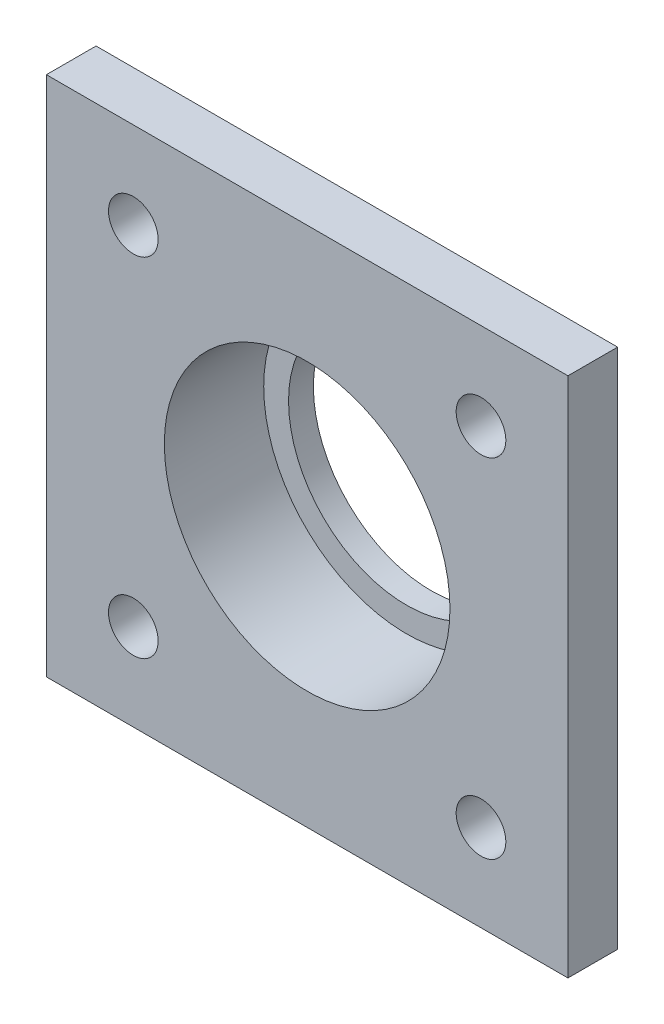
ISO-10303-21;
HEADER;
FILE_DESCRIPTION(('STEP AP214'),'2;1');
FILE_NAME('part.step','',(''),(''),'','','');
FILE_SCHEMA(('AUTOMOTIVE_DESIGN { 1 0 10303 214 1 1 1 1 }'));
ENDSEC;
DATA;
#1=APPLICATION_CONTEXT('core data for automotive mechanical design processes');
#2=APPLICATION_PROTOCOL_DEFINITION('international standard','automotive_design',2000,#1);
#3=PRODUCT_CONTEXT('',#1,'mechanical');
#4=PRODUCT('Part','Part','',(#3));
#5=PRODUCT_RELATED_PRODUCT_CATEGORY('part','',(#4));
#6=PRODUCT_DEFINITION_FORMATION('','',#4);
#7=PRODUCT_DEFINITION_CONTEXT('part definition',#1,'design');
#8=PRODUCT_DEFINITION('design','',#6,#7);
#9=PRODUCT_DEFINITION_SHAPE('','',#8);
#10=(LENGTH_UNIT() NAMED_UNIT(*) SI_UNIT(.MILLI.,.METRE.));
#11=(NAMED_UNIT(*) PLANE_ANGLE_UNIT() SI_UNIT($,.RADIAN.));
#12=(NAMED_UNIT(*) SI_UNIT($,.STERADIAN.) SOLID_ANGLE_UNIT());
#13=UNCERTAINTY_MEASURE_WITH_UNIT(LENGTH_MEASURE(1.E-05),#10,'distance_accuracy_value','');
#14=(GEOMETRIC_REPRESENTATION_CONTEXT(3) GLOBAL_UNCERTAINTY_ASSIGNED_CONTEXT((#13)) GLOBAL_UNIT_ASSIGNED_CONTEXT((#10,
#11,#12)) REPRESENTATION_CONTEXT('',''));
#15=CARTESIAN_POINT('',(0.,0.,0.));
#16=DIRECTION('',(0.,0.,1.));
#17=DIRECTION('',(1.,0.,0.));
#18=AXIS2_PLACEMENT_3D('',#15,#16,#17);
#19=CARTESIAN_POINT('',(0.,0.,4.));
#20=DIRECTION('',(0.,0.,-1.));
#21=DIRECTION('',(-1.,0.,0.));
#22=AXIS2_PLACEMENT_3D('',#19,#20,#21);
#23=CYLINDRICAL_SURFACE('',#22,11.5);
#24=CARTESIAN_POINT('',(0.,0.,4.));
#25=DIRECTION('',(0.,0.,1.));
#26=DIRECTION('',(1.,0.,0.));
#27=AXIS2_PLACEMENT_3D('',#24,#25,#26);
#28=CIRCLE('',#27,11.5);
#29=CARTESIAN_POINT('',(11.5,0.,4.));
#30=VERTEX_POINT('',#29);
#31=EDGE_CURVE('E212',#30,#30,#28,.T.);
#32=ORIENTED_EDGE('',*,*,#31,.T.);
#33=EDGE_LOOP('',(#32));
#34=FACE_BOUND('',#33,.T.);
#35=CARTESIAN_POINT('',(0.,0.,-4.));
#36=DIRECTION('',(0.,0.,-1.));
#37=DIRECTION('',(-1.,0.,0.));
#38=AXIS2_PLACEMENT_3D('',#35,#36,#37);
#39=CIRCLE('',#38,11.5);
#40=CARTESIAN_POINT('',(-11.5,0.,-4.));
#41=VERTEX_POINT('',#40);
#42=EDGE_CURVE('E233',#41,#41,#39,.T.);
#43=ORIENTED_EDGE('',*,*,#42,.T.);
#44=EDGE_LOOP('',(#43));
#45=FACE_BOUND('',#44,.T.);
#46=ADVANCED_FACE('F41',(#34,#45),#23,.F.);
#47=CARTESIAN_POINT('',(0.,-21.,4.));
#48=DIRECTION('',(0.,1.,0.));
#49=DIRECTION('',(0.,0.,1.));
#50=AXIS2_PLACEMENT_3D('',#47,#48,#49);
#51=PLANE('',#50);
#52=DIRECTION('',(1.,0.,0.));
#53=VECTOR('',#52,1.);
#54=CARTESIAN_POINT('',(0.,-21.,0.));
#55=LINE('',#54,#53);
#56=CARTESIAN_POINT('',(-21.,-21.,0.));
#57=VERTEX_POINT('',#56);
#58=CARTESIAN_POINT('',(21.,-21.,0.));
#59=VERTEX_POINT('',#58);
#60=EDGE_CURVE('E131',#57,#59,#55,.T.);
#61=ORIENTED_EDGE('',*,*,#60,.T.);
#62=DIRECTION('',(0.,0.,-1.));
#63=VECTOR('',#62,1.);
#64=CARTESIAN_POINT('',(21.,-21.,4.));
#65=LINE('',#64,#63);
#66=CARTESIAN_POINT('',(21.,-21.,4.));
#67=VERTEX_POINT('',#66);
#68=EDGE_CURVE('E104',#67,#59,#65,.T.);
#69=ORIENTED_EDGE('',*,*,#68,.F.);
#70=DIRECTION('',(1.,0.,0.));
#71=VECTOR('',#70,1.);
#72=CARTESIAN_POINT('',(0.,-21.,4.));
#73=LINE('',#72,#71);
#74=CARTESIAN_POINT('',(-21.,-21.,4.));
#75=VERTEX_POINT('',#74);
#76=EDGE_CURVE('E93',#75,#67,#73,.T.);
#77=ORIENTED_EDGE('',*,*,#76,.F.);
#78=DIRECTION('',(0.,0.,-1.));
#79=VECTOR('',#78,1.);
#80=CARTESIAN_POINT('',(-21.,-21.,4.));
#81=LINE('',#80,#79);
#82=EDGE_CURVE('E59',#75,#57,#81,.T.);
#83=ORIENTED_EDGE('',*,*,#82,.T.);
#84=EDGE_LOOP('',(#61,#69,#77,#83));
#85=FACE_BOUND('',#84,.T.);
#86=ADVANCED_FACE('F167',(#85),#51,.F.);
#87=CARTESIAN_POINT('',(21.,0.,4.));
#88=DIRECTION('',(-1.,0.,0.));
#89=DIRECTION('',(0.,0.,1.));
#90=AXIS2_PLACEMENT_3D('',#87,#88,#89);
#91=PLANE('',#90);
#92=DIRECTION('',(0.,1.,0.));
#93=VECTOR('',#92,1.);
#94=CARTESIAN_POINT('',(21.,0.,0.));
#95=LINE('',#94,#93);
#96=CARTESIAN_POINT('',(21.,21.,0.));
#97=VERTEX_POINT('',#96);
#98=EDGE_CURVE('E100',#59,#97,#95,.T.);
#99=ORIENTED_EDGE('',*,*,#98,.T.);
#100=DIRECTION('',(0.,0.,-1.));
#101=VECTOR('',#100,1.);
#102=CARTESIAN_POINT('',(21.,21.,4.));
#103=LINE('',#102,#101);
#104=CARTESIAN_POINT('',(21.,21.,4.));
#105=VERTEX_POINT('',#104);
#106=EDGE_CURVE('E98',#105,#97,#103,.T.);
#107=ORIENTED_EDGE('',*,*,#106,.F.);
#108=DIRECTION('',(0.,1.,0.));
#109=VECTOR('',#108,1.);
#110=CARTESIAN_POINT('',(21.,0.,4.));
#111=LINE('',#110,#109);
#112=EDGE_CURVE('E85',#67,#105,#111,.T.);
#113=ORIENTED_EDGE('',*,*,#112,.F.);
#114=ORIENTED_EDGE('',*,*,#68,.T.);
#115=EDGE_LOOP('',(#99,#107,#113,#114));
#116=FACE_BOUND('',#115,.T.);
#117=ADVANCED_FACE('F99',(#116),#91,.F.);
#118=CARTESIAN_POINT('',(0.,21.,4.));
#119=DIRECTION('',(0.,1.,0.));
#120=DIRECTION('',(0.,0.,1.));
#121=AXIS2_PLACEMENT_3D('',#118,#119,#120);
#122=PLANE('',#121);
#123=DIRECTION('',(1.,0.,0.));
#124=VECTOR('',#123,1.);
#125=CARTESIAN_POINT('',(0.,21.,0.));
#126=LINE('',#125,#124);
#127=CARTESIAN_POINT('',(-21.,21.,0.));
#128=VERTEX_POINT('',#127);
#129=EDGE_CURVE('E136',#128,#97,#126,.T.);
#130=ORIENTED_EDGE('',*,*,#129,.F.);
#131=DIRECTION('',(0.,0.,-1.));
#132=VECTOR('',#131,1.);
#133=CARTESIAN_POINT('',(-21.,21.,4.));
#134=LINE('',#133,#132);
#135=CARTESIAN_POINT('',(-21.,21.,4.));
#136=VERTEX_POINT('',#135);
#137=EDGE_CURVE('E73',#136,#128,#134,.T.);
#138=ORIENTED_EDGE('',*,*,#137,.F.);
#139=DIRECTION('',(1.,0.,0.));
#140=VECTOR('',#139,1.);
#141=CARTESIAN_POINT('',(0.,21.,4.));
#142=LINE('',#141,#140);
#143=EDGE_CURVE('E92',#136,#105,#142,.T.);
#144=ORIENTED_EDGE('',*,*,#143,.T.);
#145=ORIENTED_EDGE('',*,*,#106,.T.);
#146=EDGE_LOOP('',(#130,#138,#144,#145));
#147=FACE_BOUND('',#146,.T.);
#148=ADVANCED_FACE('F106',(#147),#122,.T.);
#149=CARTESIAN_POINT('',(-14.,14.,4.));
#150=DIRECTION('',(0.,0.,-1.));
#151=DIRECTION('',(-1.,0.,0.));
#152=AXIS2_PLACEMENT_3D('',#149,#150,#151);
#153=CYLINDRICAL_SURFACE('',#152,2.);
#154=CARTESIAN_POINT('',(-14.,14.,4.));
#155=DIRECTION('',(0.,0.,1.));
#156=DIRECTION('',(1.,0.,0.));
#157=AXIS2_PLACEMENT_3D('',#154,#155,#156);
#158=CIRCLE('',#157,2.);
#159=CARTESIAN_POINT('',(-12.,14.,4.));
#160=VERTEX_POINT('',#159);
#161=EDGE_CURVE('E214',#160,#160,#158,.T.);
#162=ORIENTED_EDGE('',*,*,#161,.T.);
#163=EDGE_LOOP('',(#162));
#164=FACE_BOUND('',#163,.T.);
#165=CARTESIAN_POINT('',(-14.,14.,0.));
#166=DIRECTION('',(0.,0.,1.));
#167=DIRECTION('',(1.,0.,0.));
#168=AXIS2_PLACEMENT_3D('',#165,#166,#167);
#169=CIRCLE('',#168,2.);
#170=CARTESIAN_POINT('',(-12.,14.,0.));
#171=VERTEX_POINT('',#170);
#172=EDGE_CURVE('E127',#171,#171,#169,.T.);
#173=ORIENTED_EDGE('',*,*,#172,.F.);
#174=EDGE_LOOP('',(#173));
#175=FACE_BOUND('',#174,.T.);
#176=ADVANCED_FACE('F178',(#164,#175),#153,.F.);
#177=CARTESIAN_POINT('',(14.,14.000000000001,4.));
#178=DIRECTION('',(0.,0.,-1.));
#179=DIRECTION('',(-1.,0.,0.));
#180=AXIS2_PLACEMENT_3D('',#177,#178,#179);
#181=CYLINDRICAL_SURFACE('',#180,2.00000000000001);
#182=CARTESIAN_POINT('',(14.,14.000000000001,4.));
#183=DIRECTION('',(0.,0.,1.));
#184=DIRECTION('',(1.,0.,0.));
#185=AXIS2_PLACEMENT_3D('',#182,#183,#184);
#186=CIRCLE('',#185,2.00000000000001);
#187=CARTESIAN_POINT('',(16.,14.000000000001,4.));
#188=VERTEX_POINT('',#187);
#189=EDGE_CURVE('E220',#188,#188,#186,.T.);
#190=ORIENTED_EDGE('',*,*,#189,.T.);
#191=EDGE_LOOP('',(#190));
#192=FACE_BOUND('',#191,.T.);
#193=CARTESIAN_POINT('',(14.,14.000000000001,0.));
#194=DIRECTION('',(0.,0.,1.));
#195=DIRECTION('',(1.,0.,0.));
#196=AXIS2_PLACEMENT_3D('',#193,#194,#195);
#197=CIRCLE('',#196,2.00000000000001);
#198=CARTESIAN_POINT('',(16.,14.000000000001,0.));
#199=VERTEX_POINT('',#198);
#200=EDGE_CURVE('E123',#199,#199,#197,.T.);
#201=ORIENTED_EDGE('',*,*,#200,.F.);
#202=EDGE_LOOP('',(#201));
#203=FACE_BOUND('',#202,.T.);
#204=ADVANCED_FACE('F181',(#192,#203),#181,.F.);
#205=CARTESIAN_POINT('',(14.000000000001,-13.999999999999,4.));
#206=DIRECTION('',(0.,0.,-1.));
#207=DIRECTION('',(-1.,0.,0.));
#208=AXIS2_PLACEMENT_3D('',#205,#206,#207);
#209=CYLINDRICAL_SURFACE('',#208,2.);
#210=CARTESIAN_POINT('',(14.000000000001,-13.999999999999,4.));
#211=DIRECTION('',(0.,0.,1.));
#212=DIRECTION('',(1.,0.,0.));
#213=AXIS2_PLACEMENT_3D('',#210,#211,#212);
#214=CIRCLE('',#213,2.);
#215=CARTESIAN_POINT('',(16.000000000001,-13.999999999999,4.));
#216=VERTEX_POINT('',#215);
#217=EDGE_CURVE('E224',#216,#216,#214,.T.);
#218=ORIENTED_EDGE('',*,*,#217,.T.);
#219=EDGE_LOOP('',(#218));
#220=FACE_BOUND('',#219,.T.);
#221=CARTESIAN_POINT('',(14.000000000001,-13.999999999999,0.));
#222=DIRECTION('',(0.,0.,1.));
#223=DIRECTION('',(1.,0.,0.));
#224=AXIS2_PLACEMENT_3D('',#221,#222,#223);
#225=CIRCLE('',#224,2.);
#226=CARTESIAN_POINT('',(16.000000000001,-13.999999999999,0.));
#227=VERTEX_POINT('',#226);
#228=EDGE_CURVE('E118',#227,#227,#225,.T.);
#229=ORIENTED_EDGE('',*,*,#228,.F.);
#230=EDGE_LOOP('',(#229));
#231=FACE_BOUND('',#230,.T.);
#232=ADVANCED_FACE('F185',(#220,#231),#209,.F.);
#233=CARTESIAN_POINT('',(-13.999999999999,-14.,4.));
#234=DIRECTION('',(0.,0.,-1.));
#235=DIRECTION('',(-1.,0.,0.));
#236=AXIS2_PLACEMENT_3D('',#233,#234,#235);
#237=CYLINDRICAL_SURFACE('',#236,2.);
#238=CARTESIAN_POINT('',(-13.999999999999,-14.,4.));
#239=DIRECTION('',(0.,0.,1.));
#240=DIRECTION('',(1.,0.,0.));
#241=AXIS2_PLACEMENT_3D('',#238,#239,#240);
#242=CIRCLE('',#241,2.);
#243=CARTESIAN_POINT('',(-11.999999999999,-14.,4.));
#244=VERTEX_POINT('',#243);
#245=EDGE_CURVE('E143',#244,#244,#242,.T.);
#246=ORIENTED_EDGE('',*,*,#245,.T.);
#247=EDGE_LOOP('',(#246));
#248=FACE_BOUND('',#247,.T.);
#249=CARTESIAN_POINT('',(-13.999999999999,-14.,0.));
#250=DIRECTION('',(0.,0.,1.));
#251=DIRECTION('',(1.,0.,0.));
#252=AXIS2_PLACEMENT_3D('',#249,#250,#251);
#253=CIRCLE('',#252,2.);
#254=CARTESIAN_POINT('',(-11.999999999999,-14.,0.));
#255=VERTEX_POINT('',#254);
#256=EDGE_CURVE('E114',#255,#255,#253,.T.);
#257=ORIENTED_EDGE('',*,*,#256,.F.);
#258=EDGE_LOOP('',(#257));
#259=FACE_BOUND('',#258,.T.);
#260=ADVANCED_FACE('F188',(#248,#259),#237,.F.);
#261=CARTESIAN_POINT('',(-21.,0.,4.));
#262=DIRECTION('',(-1.,0.,0.));
#263=DIRECTION('',(0.,0.,1.));
#264=AXIS2_PLACEMENT_3D('',#261,#262,#263);
#265=PLANE('',#264);
#266=DIRECTION('',(0.,1.,0.));
#267=VECTOR('',#266,1.);
#268=CARTESIAN_POINT('',(-21.,0.,0.));
#269=LINE('',#268,#267);
#270=EDGE_CURVE('E139',#57,#128,#269,.T.);
#271=ORIENTED_EDGE('',*,*,#270,.F.);
#272=ORIENTED_EDGE('',*,*,#82,.F.);
#273=DIRECTION('',(0.,1.,0.));
#274=VECTOR('',#273,1.);
#275=CARTESIAN_POINT('',(-21.,0.,4.));
#276=LINE('',#275,#274);
#277=EDGE_CURVE('E108',#75,#136,#276,.T.);
#278=ORIENTED_EDGE('',*,*,#277,.T.);
#279=ORIENTED_EDGE('',*,*,#137,.T.);
#280=EDGE_LOOP('',(#271,#272,#278,#279));
#281=FACE_BOUND('',#280,.T.);
#282=ADVANCED_FACE('F191',(#281),#265,.T.);
#283=CARTESIAN_POINT('',(0.,0.,4.));
#284=DIRECTION('',(0.,0.,1.));
#285=DIRECTION('',(1.,0.,0.));
#286=AXIS2_PLACEMENT_3D('',#283,#284,#285);
#287=PLANE('',#286);
#288=ORIENTED_EDGE('',*,*,#245,.F.);
#289=EDGE_LOOP('',(#288));
#290=FACE_BOUND('',#289,.T.);
#291=ORIENTED_EDGE('',*,*,#217,.F.);
#292=EDGE_LOOP('',(#291));
#293=FACE_BOUND('',#292,.T.);
#294=ORIENTED_EDGE('',*,*,#189,.F.);
#295=EDGE_LOOP('',(#294));
#296=FACE_BOUND('',#295,.T.);
#297=ORIENTED_EDGE('',*,*,#161,.F.);
#298=EDGE_LOOP('',(#297));
#299=FACE_BOUND('',#298,.T.);
#300=ORIENTED_EDGE('',*,*,#31,.F.);
#301=EDGE_LOOP('',(#300));
#302=FACE_BOUND('',#301,.T.);
#303=ORIENTED_EDGE('',*,*,#76,.T.);
#304=ORIENTED_EDGE('',*,*,#112,.T.);
#305=ORIENTED_EDGE('',*,*,#143,.F.);
#306=ORIENTED_EDGE('',*,*,#277,.F.);
#307=EDGE_LOOP('',(#303,#304,#305,#306));
#308=FACE_BOUND('',#307,.T.);
#309=ADVANCED_FACE('F89',(#290,#293,#296,#299,#302,#308),#287,.T.);
#310=CARTESIAN_POINT('',(0.,0.,0.));
#311=DIRECTION('',(0.,0.,1.));
#312=DIRECTION('',(1.,0.,0.));
#313=AXIS2_PLACEMENT_3D('',#310,#311,#312);
#314=PLANE('',#313);
#315=CARTESIAN_POINT('',(0.,0.,0.));
#316=DIRECTION('',(0.,0.,1.));
#317=DIRECTION('',(1.,0.,0.));
#318=AXIS2_PLACEMENT_3D('',#315,#316,#317);
#319=CIRCLE('',#318,17.);
#320=CARTESIAN_POINT('',(17.,0.,0.));
#321=VERTEX_POINT('',#320);
#322=EDGE_CURVE('E51',#321,#321,#319,.T.);
#323=ORIENTED_EDGE('',*,*,#322,.T.);
#324=EDGE_LOOP('',(#323));
#325=FACE_BOUND('',#324,.T.);
#326=ORIENTED_EDGE('',*,*,#256,.T.);
#327=EDGE_LOOP('',(#326));
#328=FACE_BOUND('',#327,.T.);
#329=ORIENTED_EDGE('',*,*,#228,.T.);
#330=EDGE_LOOP('',(#329));
#331=FACE_BOUND('',#330,.T.);
#332=ORIENTED_EDGE('',*,*,#200,.T.);
#333=EDGE_LOOP('',(#332));
#334=FACE_BOUND('',#333,.T.);
#335=ORIENTED_EDGE('',*,*,#172,.T.);
#336=EDGE_LOOP('',(#335));
#337=FACE_BOUND('',#336,.T.);
#338=ORIENTED_EDGE('',*,*,#60,.F.);
#339=ORIENTED_EDGE('',*,*,#270,.T.);
#340=ORIENTED_EDGE('',*,*,#129,.T.);
#341=ORIENTED_EDGE('',*,*,#98,.F.);
#342=EDGE_LOOP('',(#338,#339,#340,#341));
#343=FACE_BOUND('',#342,.T.);
#344=ADVANCED_FACE('F153',(#325,#328,#331,#334,#337,#343),#314,.F.);
#345=CARTESIAN_POINT('',(0.,0.,-6.));
#346=DIRECTION('',(0.,0.,1.));
#347=DIRECTION('',(1.,0.,0.));
#348=AXIS2_PLACEMENT_3D('',#345,#346,#347);
#349=CYLINDRICAL_SURFACE('',#348,15.);
#350=CARTESIAN_POINT('',(0.,0.,-2.));
#351=DIRECTION('',(0.,0.,1.));
#352=DIRECTION('',(1.,0.,0.));
#353=AXIS2_PLACEMENT_3D('',#350,#351,#352);
#354=CIRCLE('',#353,15.);
#355=CARTESIAN_POINT('',(15.,0.,-2.));
#356=VERTEX_POINT('',#355);
#357=EDGE_CURVE('E11',#356,#356,#354,.F.);
#358=ORIENTED_EDGE('',*,*,#357,.T.);
#359=EDGE_LOOP('',(#358));
#360=FACE_BOUND('',#359,.T.);
#361=CARTESIAN_POINT('',(0.,0.,-6.));
#362=DIRECTION('',(0.,0.,1.));
#363=DIRECTION('',(1.,0.,0.));
#364=AXIS2_PLACEMENT_3D('',#361,#362,#363);
#365=CIRCLE('',#364,15.);
#366=CARTESIAN_POINT('',(15.,0.,-6.));
#367=VERTEX_POINT('',#366);
#368=EDGE_CURVE('E119',#367,#367,#365,.T.);
#369=ORIENTED_EDGE('',*,*,#368,.T.);
#370=EDGE_LOOP('',(#369));
#371=FACE_BOUND('',#370,.T.);
#372=ADVANCED_FACE('F203',(#360,#371),#349,.T.);
#373=CARTESIAN_POINT('',(0.,0.,-6.));
#374=DIRECTION('',(0.,0.,1.));
#375=DIRECTION('',(1.,0.,0.));
#376=AXIS2_PLACEMENT_3D('',#373,#374,#375);
#377=PLANE('',#376);
#378=ORIENTED_EDGE('',*,*,#368,.F.);
#379=EDGE_LOOP('',(#378));
#380=FACE_BOUND('',#379,.T.);
#381=CARTESIAN_POINT('',(0.,0.,-6.));
#382=DIRECTION('',(0.,0.,-1.));
#383=DIRECTION('',(-1.,0.,0.));
#384=AXIS2_PLACEMENT_3D('',#381,#382,#383);
#385=CIRCLE('',#384,9.5);
#386=CARTESIAN_POINT('',(-9.5,0.,-6.));
#387=VERTEX_POINT('',#386);
#388=EDGE_CURVE('E238',#387,#387,#385,.T.);
#389=ORIENTED_EDGE('',*,*,#388,.F.);
#390=EDGE_LOOP('',(#389));
#391=FACE_BOUND('',#390,.T.);
#392=ADVANCED_FACE('F250',(#380,#391),#377,.F.);
#393=CARTESIAN_POINT('',(0.,0.,-4.));
#394=DIRECTION('',(0.,0.,-1.));
#395=DIRECTION('',(-1.,0.,0.));
#396=AXIS2_PLACEMENT_3D('',#393,#394,#395);
#397=PLANE('',#396);
#398=CARTESIAN_POINT('',(0.,0.,-4.));
#399=DIRECTION('',(0.,0.,-1.));
#400=DIRECTION('',(-1.,0.,0.));
#401=AXIS2_PLACEMENT_3D('',#398,#399,#400);
#402=CIRCLE('',#401,9.5);
#403=CARTESIAN_POINT('',(-9.5,0.,-4.));
#404=VERTEX_POINT('',#403);
#405=EDGE_CURVE('E237',#404,#404,#402,.T.);
#406=ORIENTED_EDGE('',*,*,#405,.T.);
#407=EDGE_LOOP('',(#406));
#408=FACE_BOUND('',#407,.T.);
#409=ORIENTED_EDGE('',*,*,#42,.F.);
#410=EDGE_LOOP('',(#409));
#411=FACE_BOUND('',#410,.T.);
#412=ADVANCED_FACE('F162',(#408,#411),#397,.F.);
#413=CARTESIAN_POINT('',(0.,0.,-4.));
#414=DIRECTION('',(0.,0.,-1.));
#415=DIRECTION('',(-1.,0.,0.));
#416=AXIS2_PLACEMENT_3D('',#413,#414,#415);
#417=CYLINDRICAL_SURFACE('',#416,9.5);
#418=ORIENTED_EDGE('',*,*,#405,.F.);
#419=EDGE_LOOP('',(#418));
#420=FACE_BOUND('',#419,.T.);
#421=ORIENTED_EDGE('',*,*,#388,.T.);
#422=EDGE_LOOP('',(#421));
#423=FACE_BOUND('',#422,.T.);
#424=ADVANCED_FACE('F157',(#420,#423),#417,.F.);
#425=CARTESIAN_POINT('',(0.,0.,-2.));
#426=DIRECTION('',(0.,0.,1.));
#427=DIRECTION('',(1.,0.,0.));
#428=AXIS2_PLACEMENT_3D('',#425,#426,#427);
#429=TOROIDAL_SURFACE('',#428,17.,2.);
#430=ORIENTED_EDGE('',*,*,#357,.F.);
#431=EDGE_LOOP('',(#430));
#432=FACE_BOUND('',#431,.T.);
#433=ORIENTED_EDGE('',*,*,#322,.F.);
#434=EDGE_LOOP('',(#433));
#435=FACE_BOUND('',#434,.T.);
#436=ADVANCED_FACE('F43',(#432,#435),#429,.F.);
#437=CLOSED_SHELL('',(#46,#86,#117,#148,#176,#204,#232,#260,#282,#309,#344,#372,#392,#412,#424,#436));
#438=MANIFOLD_SOLID_BREP('B2',#437);
#439=ADVANCED_BREP_SHAPE_REPRESENTATION('',(#18,#438),#14);
#440=SHAPE_DEFINITION_REPRESENTATION(#9,#439);
ENDSEC;
END-ISO-10303-21;
